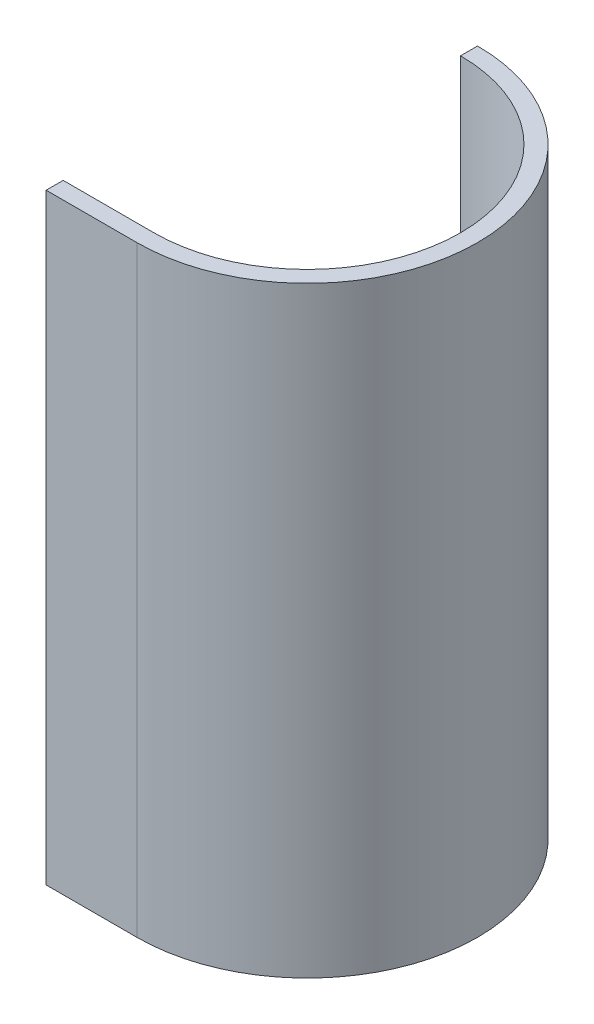
ISO-10303-21;
HEADER;
FILE_DESCRIPTION(('STEP AP214'),'2;1');
FILE_NAME('part.step','',(''),(''),'','','');
FILE_SCHEMA(('AUTOMOTIVE_DESIGN { 1 0 10303 214 1 1 1 1 }'));
ENDSEC;
DATA;
#1=APPLICATION_CONTEXT('core data for automotive mechanical design processes');
#2=APPLICATION_PROTOCOL_DEFINITION('international standard','automotive_design',2000,#1);
#3=PRODUCT_CONTEXT('',#1,'mechanical');
#4=PRODUCT('Part','Part','',(#3));
#5=PRODUCT_RELATED_PRODUCT_CATEGORY('part','',(#4));
#6=PRODUCT_DEFINITION_FORMATION('','',#4);
#7=PRODUCT_DEFINITION_CONTEXT('part definition',#1,'design');
#8=PRODUCT_DEFINITION('design','',#6,#7);
#9=PRODUCT_DEFINITION_SHAPE('','',#8);
#10=(LENGTH_UNIT() NAMED_UNIT(*) SI_UNIT(.MILLI.,.METRE.));
#11=(NAMED_UNIT(*) PLANE_ANGLE_UNIT() SI_UNIT($,.RADIAN.));
#12=(NAMED_UNIT(*) SI_UNIT($,.STERADIAN.) SOLID_ANGLE_UNIT());
#13=UNCERTAINTY_MEASURE_WITH_UNIT(LENGTH_MEASURE(1.E-05),#10,'distance_accuracy_value','');
#14=(GEOMETRIC_REPRESENTATION_CONTEXT(3) GLOBAL_UNCERTAINTY_ASSIGNED_CONTEXT((#13)) GLOBAL_UNIT_ASSIGNED_CONTEXT((#10,
#11,#12)) REPRESENTATION_CONTEXT('',''));
#15=CARTESIAN_POINT('',(0.,0.,0.));
#16=DIRECTION('',(0.,0.,1.));
#17=DIRECTION('',(1.,0.,0.));
#18=AXIS2_PLACEMENT_3D('',#15,#16,#17);
#19=CARTESIAN_POINT('',(0.,53.,0.));
#20=DIRECTION('',(0.,-1.,0.));
#21=DIRECTION('',(0.,0.,-1.));
#22=AXIS2_PLACEMENT_3D('',#19,#20,#21);
#23=CYLINDRICAL_SURFACE('',#22,13.5);
#24=CARTESIAN_POINT('',(0.,0.,0.));
#25=DIRECTION('',(0.,-1.,0.));
#26=DIRECTION('',(0.,0.,1.));
#27=AXIS2_PLACEMENT_3D('',#24,#25,#26);
#28=CIRCLE('',#27,13.5);
#29=CARTESIAN_POINT('',(0.,0.,-13.5));
#30=VERTEX_POINT('',#29);
#31=CARTESIAN_POINT('',(0.,0.,13.5));
#32=VERTEX_POINT('',#31);
#33=EDGE_CURVE('E121',#30,#32,#28,.T.);
#34=ORIENTED_EDGE('',*,*,#33,.T.);
#35=DIRECTION('',(0.,-1.,0.));
#36=VECTOR('',#35,1.);
#37=CARTESIAN_POINT('',(0.,53.,13.5));
#38=LINE('',#37,#36);
#39=CARTESIAN_POINT('',(0.,53.,13.5));
#40=VERTEX_POINT('',#39);
#41=EDGE_CURVE('E11',#40,#32,#38,.T.);
#42=ORIENTED_EDGE('',*,*,#41,.F.);
#43=CARTESIAN_POINT('',(0.,53.,0.));
#44=DIRECTION('',(0.,-1.,0.));
#45=DIRECTION('',(0.,0.,1.));
#46=AXIS2_PLACEMENT_3D('',#43,#44,#45);
#47=CIRCLE('',#46,13.5);
#48=CARTESIAN_POINT('',(0.,53.,-13.5));
#49=VERTEX_POINT('',#48);
#50=EDGE_CURVE('E131',#49,#40,#47,.T.);
#51=ORIENTED_EDGE('',*,*,#50,.F.);
#52=DIRECTION('',(0.,-1.,0.));
#53=VECTOR('',#52,1.);
#54=CARTESIAN_POINT('',(0.,53.,-13.5));
#55=LINE('',#54,#53);
#56=EDGE_CURVE('E117',#49,#30,#55,.T.);
#57=ORIENTED_EDGE('',*,*,#56,.T.);
#58=EDGE_LOOP('',(#34,#42,#51,#57));
#59=FACE_BOUND('',#58,.T.);
#60=ADVANCED_FACE('F37',(#59),#23,.F.);
#61=CARTESIAN_POINT('',(0.,53.,13.5));
#62=DIRECTION('',(0.,0.,1.));
#63=DIRECTION('',(1.,0.,0.));
#64=AXIS2_PLACEMENT_3D('',#61,#62,#63);
#65=PLANE('',#64);
#66=DIRECTION('',(-1.,0.,0.));
#67=VECTOR('',#66,1.);
#68=CARTESIAN_POINT('',(0.,0.,13.5));
#69=LINE('',#68,#67);
#70=CARTESIAN_POINT('',(-8.,0.,13.5));
#71=VERTEX_POINT('',#70);
#72=EDGE_CURVE('E124',#32,#71,#69,.T.);
#73=ORIENTED_EDGE('',*,*,#72,.T.);
#74=DIRECTION('',(0.,-1.,0.));
#75=VECTOR('',#74,1.);
#76=CARTESIAN_POINT('',(-8.,53.,13.5));
#77=LINE('',#76,#75);
#78=CARTESIAN_POINT('',(-8.,53.,13.5));
#79=VERTEX_POINT('',#78);
#80=EDGE_CURVE('E45',#79,#71,#77,.T.);
#81=ORIENTED_EDGE('',*,*,#80,.F.);
#82=DIRECTION('',(-1.,0.,0.));
#83=VECTOR('',#82,1.);
#84=CARTESIAN_POINT('',(0.,53.,13.5));
#85=LINE('',#84,#83);
#86=EDGE_CURVE('E90',#40,#79,#85,.T.);
#87=ORIENTED_EDGE('',*,*,#86,.F.);
#88=ORIENTED_EDGE('',*,*,#41,.T.);
#89=EDGE_LOOP('',(#73,#81,#87,#88));
#90=FACE_BOUND('',#89,.T.);
#91=ADVANCED_FACE('F155',(#90),#65,.F.);
#92=CARTESIAN_POINT('',(-8.,53.,13.5));
#93=DIRECTION('',(1.,0.,0.));
#94=DIRECTION('',(0.,0.,-1.));
#95=AXIS2_PLACEMENT_3D('',#92,#93,#94);
#96=PLANE('',#95);
#97=DIRECTION('',(0.,0.,1.));
#98=VECTOR('',#97,1.);
#99=CARTESIAN_POINT('',(-8.,0.,13.5));
#100=LINE('',#99,#98);
#101=CARTESIAN_POINT('',(-8.,0.,15.));
#102=VERTEX_POINT('',#101);
#103=EDGE_CURVE('E126',#71,#102,#100,.T.);
#104=ORIENTED_EDGE('',*,*,#103,.T.);
#105=DIRECTION('',(0.,-1.,0.));
#106=VECTOR('',#105,1.);
#107=CARTESIAN_POINT('',(-8.,53.,15.));
#108=LINE('',#107,#106);
#109=CARTESIAN_POINT('',(-8.,53.,15.));
#110=VERTEX_POINT('',#109);
#111=EDGE_CURVE('E112',#110,#102,#108,.T.);
#112=ORIENTED_EDGE('',*,*,#111,.F.);
#113=DIRECTION('',(0.,0.,1.));
#114=VECTOR('',#113,1.);
#115=CARTESIAN_POINT('',(-8.,53.,13.5));
#116=LINE('',#115,#114);
#117=EDGE_CURVE('E103',#79,#110,#116,.T.);
#118=ORIENTED_EDGE('',*,*,#117,.F.);
#119=ORIENTED_EDGE('',*,*,#80,.T.);
#120=EDGE_LOOP('',(#104,#112,#118,#119));
#121=FACE_BOUND('',#120,.T.);
#122=ADVANCED_FACE('F137',(#121),#96,.F.);
#123=CARTESIAN_POINT('',(-8.,53.,15.));
#124=DIRECTION('',(0.,0.,-1.));
#125=DIRECTION('',(-1.,0.,0.));
#126=AXIS2_PLACEMENT_3D('',#123,#124,#125);
#127=PLANE('',#126);
#128=DIRECTION('',(1.,0.,0.));
#129=VECTOR('',#128,1.);
#130=CARTESIAN_POINT('',(-8.,0.,15.));
#131=LINE('',#130,#129);
#132=CARTESIAN_POINT('',(0.,0.,15.));
#133=VERTEX_POINT('',#132);
#134=EDGE_CURVE('E111',#102,#133,#131,.T.);
#135=ORIENTED_EDGE('',*,*,#134,.T.);
#136=DIRECTION('',(0.,-1.,0.));
#137=VECTOR('',#136,1.);
#138=CARTESIAN_POINT('',(0.,53.,15.));
#139=LINE('',#138,#137);
#140=CARTESIAN_POINT('',(0.,53.,15.));
#141=VERTEX_POINT('',#140);
#142=EDGE_CURVE('E108',#141,#133,#139,.T.);
#143=ORIENTED_EDGE('',*,*,#142,.F.);
#144=DIRECTION('',(1.,0.,0.));
#145=VECTOR('',#144,1.);
#146=CARTESIAN_POINT('',(-8.,53.,15.));
#147=LINE('',#146,#145);
#148=EDGE_CURVE('E97',#110,#141,#147,.T.);
#149=ORIENTED_EDGE('',*,*,#148,.F.);
#150=ORIENTED_EDGE('',*,*,#111,.T.);
#151=EDGE_LOOP('',(#135,#143,#149,#150));
#152=FACE_BOUND('',#151,.T.);
#153=ADVANCED_FACE('F109',(#152),#127,.F.);
#154=CARTESIAN_POINT('',(0.,53.,0.));
#155=DIRECTION('',(0.,-1.,0.));
#156=DIRECTION('',(0.,0.,-1.));
#157=AXIS2_PLACEMENT_3D('',#154,#155,#156);
#158=CYLINDRICAL_SURFACE('',#157,15.);
#159=CARTESIAN_POINT('',(0.,0.,0.));
#160=DIRECTION('',(0.,1.,0.));
#161=DIRECTION('',(0.,0.,1.));
#162=AXIS2_PLACEMENT_3D('',#159,#160,#161);
#163=CIRCLE('',#162,15.);
#164=CARTESIAN_POINT('',(0.,0.,-15.));
#165=VERTEX_POINT('',#164);
#166=EDGE_CURVE('E76',#133,#165,#163,.T.);
#167=ORIENTED_EDGE('',*,*,#166,.T.);
#168=DIRECTION('',(0.,-1.,0.));
#169=VECTOR('',#168,1.);
#170=CARTESIAN_POINT('',(0.,53.,-15.));
#171=LINE('',#170,#169);
#172=CARTESIAN_POINT('',(0.,53.,-15.));
#173=VERTEX_POINT('',#172);
#174=EDGE_CURVE('E113',#173,#165,#171,.T.);
#175=ORIENTED_EDGE('',*,*,#174,.F.);
#176=CARTESIAN_POINT('',(0.,53.,0.));
#177=DIRECTION('',(0.,1.,0.));
#178=DIRECTION('',(0.,0.,1.));
#179=AXIS2_PLACEMENT_3D('',#176,#177,#178);
#180=CIRCLE('',#179,15.);
#181=EDGE_CURVE('E101',#141,#173,#180,.T.);
#182=ORIENTED_EDGE('',*,*,#181,.F.);
#183=ORIENTED_EDGE('',*,*,#142,.T.);
#184=EDGE_LOOP('',(#167,#175,#182,#183));
#185=FACE_BOUND('',#184,.T.);
#186=ADVANCED_FACE('F115',(#185),#158,.T.);
#187=CARTESIAN_POINT('',(0.,53.,-15.));
#188=DIRECTION('',(1.,0.,0.));
#189=DIRECTION('',(0.,0.,-1.));
#190=AXIS2_PLACEMENT_3D('',#187,#188,#189);
#191=PLANE('',#190);
#192=DIRECTION('',(0.,0.,1.));
#193=VECTOR('',#192,1.);
#194=CARTESIAN_POINT('',(0.,0.,-15.));
#195=LINE('',#194,#193);
#196=EDGE_CURVE('E82',#165,#30,#195,.T.);
#197=ORIENTED_EDGE('',*,*,#196,.T.);
#198=ORIENTED_EDGE('',*,*,#56,.F.);
#199=DIRECTION('',(0.,0.,1.));
#200=VECTOR('',#199,1.);
#201=CARTESIAN_POINT('',(0.,53.,-15.));
#202=LINE('',#201,#200);
#203=EDGE_CURVE('E53',#173,#49,#202,.T.);
#204=ORIENTED_EDGE('',*,*,#203,.F.);
#205=ORIENTED_EDGE('',*,*,#174,.T.);
#206=EDGE_LOOP('',(#197,#198,#204,#205));
#207=FACE_BOUND('',#206,.T.);
#208=ADVANCED_FACE('F144',(#207),#191,.F.);
#209=CARTESIAN_POINT('',(0.,53.,0.));
#210=DIRECTION('',(0.,1.,0.));
#211=DIRECTION('',(0.,0.,1.));
#212=AXIS2_PLACEMENT_3D('',#209,#210,#211);
#213=PLANE('',#212);
#214=ORIENTED_EDGE('',*,*,#50,.T.);
#215=ORIENTED_EDGE('',*,*,#86,.T.);
#216=ORIENTED_EDGE('',*,*,#117,.T.);
#217=ORIENTED_EDGE('',*,*,#148,.T.);
#218=ORIENTED_EDGE('',*,*,#181,.T.);
#219=ORIENTED_EDGE('',*,*,#203,.T.);
#220=EDGE_LOOP('',(#214,#215,#216,#217,#218,#219));
#221=FACE_BOUND('',#220,.T.);
#222=ADVANCED_FACE('F99',(#221),#213,.T.);
#223=CARTESIAN_POINT('',(0.,0.,0.));
#224=DIRECTION('',(0.,1.,0.));
#225=DIRECTION('',(0.,0.,1.));
#226=AXIS2_PLACEMENT_3D('',#223,#224,#225);
#227=PLANE('',#226);
#228=ORIENTED_EDGE('',*,*,#33,.F.);
#229=ORIENTED_EDGE('',*,*,#196,.F.);
#230=ORIENTED_EDGE('',*,*,#166,.F.);
#231=ORIENTED_EDGE('',*,*,#134,.F.);
#232=ORIENTED_EDGE('',*,*,#103,.F.);
#233=ORIENTED_EDGE('',*,*,#72,.F.);
#234=EDGE_LOOP('',(#228,#229,#230,#231,#232,#233));
#235=FACE_BOUND('',#234,.T.);
#236=ADVANCED_FACE('F140',(#235),#227,.F.);
#237=CLOSED_SHELL('',(#60,#91,#122,#153,#186,#208,#222,#236));
#238=MANIFOLD_SOLID_BREP('B2',#237);
#239=ADVANCED_BREP_SHAPE_REPRESENTATION('',(#18,#238),#14);
#240=SHAPE_DEFINITION_REPRESENTATION(#9,#239);
ENDSEC;
END-ISO-10303-21;
